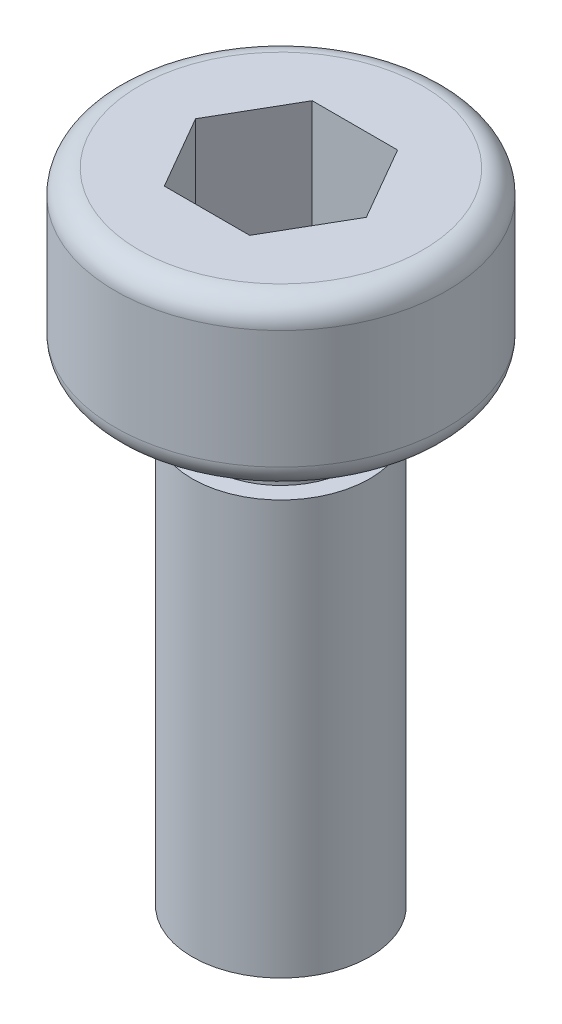
ISO-10303-21;
HEADER;
FILE_DESCRIPTION(('STEP AP214'),'2;1');
FILE_NAME('part.step','',(''),(''),'','','');
FILE_SCHEMA(('AUTOMOTIVE_DESIGN { 1 0 10303 214 1 1 1 1 }'));
ENDSEC;
DATA;
#1=APPLICATION_CONTEXT('core data for automotive mechanical design processes');
#2=APPLICATION_PROTOCOL_DEFINITION('international standard','automotive_design',2000,#1);
#3=PRODUCT_CONTEXT('',#1,'mechanical');
#4=PRODUCT('Part','Part','',(#3));
#5=PRODUCT_RELATED_PRODUCT_CATEGORY('part','',(#4));
#6=PRODUCT_DEFINITION_FORMATION('','',#4);
#7=PRODUCT_DEFINITION_CONTEXT('part definition',#1,'design');
#8=PRODUCT_DEFINITION('design','',#6,#7);
#9=PRODUCT_DEFINITION_SHAPE('','',#8);
#10=(LENGTH_UNIT() NAMED_UNIT(*) SI_UNIT(.MILLI.,.METRE.));
#11=(NAMED_UNIT(*) PLANE_ANGLE_UNIT() SI_UNIT($,.RADIAN.));
#12=(NAMED_UNIT(*) SI_UNIT($,.STERADIAN.) SOLID_ANGLE_UNIT());
#13=UNCERTAINTY_MEASURE_WITH_UNIT(LENGTH_MEASURE(1.E-05),#10,'distance_accuracy_value','');
#14=(GEOMETRIC_REPRESENTATION_CONTEXT(3) GLOBAL_UNCERTAINTY_ASSIGNED_CONTEXT((#13)) GLOBAL_UNIT_ASSIGNED_CONTEXT((#10,
#11,#12)) REPRESENTATION_CONTEXT('',''));
#15=CARTESIAN_POINT('',(0.,0.,0.));
#16=DIRECTION('',(0.,0.,1.));
#17=DIRECTION('',(1.,0.,0.));
#18=AXIS2_PLACEMENT_3D('',#15,#16,#17);
#19=CARTESIAN_POINT('',(0.,10.8,0.));
#20=DIRECTION('',(0.,-1.,0.));
#21=DIRECTION('',(0.,0.,-1.));
#22=AXIS2_PLACEMENT_3D('',#19,#20,#21);
#23=PLANE('',#22);
#24=DIRECTION('',(-0.5,0.,0.866025403784439));
#25=VECTOR('',#24,1.);
#26=CARTESIAN_POINT('',(-0.721687836487032,10.8,-1.25));
#27=LINE('',#26,#25);
#28=CARTESIAN_POINT('',(-0.721687836487032,10.8,-1.25));
#29=VERTEX_POINT('',#28);
#30=CARTESIAN_POINT('',(-1.44337567297406,10.8,0.));
#31=VERTEX_POINT('',#30);
#32=EDGE_CURVE('E124',#29,#31,#27,.T.);
#33=ORIENTED_EDGE('',*,*,#32,.F.);
#34=DIRECTION('',(-1.,0.,0.));
#35=VECTOR('',#34,1.);
#36=CARTESIAN_POINT('',(0.721687836487033,10.8,-1.25));
#37=LINE('',#36,#35);
#38=CARTESIAN_POINT('',(0.721687836487033,10.8,-1.25));
#39=VERTEX_POINT('',#38);
#40=EDGE_CURVE('E50',#39,#29,#37,.T.);
#41=ORIENTED_EDGE('',*,*,#40,.F.);
#42=DIRECTION('',(-0.5,0.,-0.866025403784439));
#43=VECTOR('',#42,1.);
#44=CARTESIAN_POINT('',(1.44337567297406,10.8,0.));
#45=LINE('',#44,#43);
#46=CARTESIAN_POINT('',(1.44337567297406,10.8,0.));
#47=VERTEX_POINT('',#46);
#48=EDGE_CURVE('E133',#47,#39,#45,.T.);
#49=ORIENTED_EDGE('',*,*,#48,.F.);
#50=DIRECTION('',(0.5,0.,-0.866025403784439));
#51=VECTOR('',#50,1.);
#52=CARTESIAN_POINT('',(0.721687836487032,10.8,1.25));
#53=LINE('',#52,#51);
#54=CARTESIAN_POINT('',(0.721687836487032,10.8,1.25));
#55=VERTEX_POINT('',#54);
#56=EDGE_CURVE('E131',#55,#47,#53,.T.);
#57=ORIENTED_EDGE('',*,*,#56,.F.);
#58=DIRECTION('',(1.,0.,0.));
#59=VECTOR('',#58,1.);
#60=CARTESIAN_POINT('',(-0.721687836487033,10.8,1.25));
#61=LINE('',#60,#59);
#62=CARTESIAN_POINT('',(-0.721687836487033,10.8,1.25));
#63=VERTEX_POINT('',#62);
#64=EDGE_CURVE('E98',#63,#55,#61,.T.);
#65=ORIENTED_EDGE('',*,*,#64,.F.);
#66=DIRECTION('',(0.5,0.,0.866025403784439));
#67=VECTOR('',#66,1.);
#68=CARTESIAN_POINT('',(-1.44337567297406,10.8,0.));
#69=LINE('',#68,#67);
#70=EDGE_CURVE('E127',#31,#63,#69,.T.);
#71=ORIENTED_EDGE('',*,*,#70,.F.);
#72=EDGE_LOOP('',(#33,#41,#49,#57,#65,#71));
#73=FACE_BOUND('',#72,.T.);
#74=CARTESIAN_POINT('',(0.,10.8,0.));
#75=DIRECTION('',(0.,-1.,0.));
#76=DIRECTION('',(0.,0.,-1.));
#77=AXIS2_PLACEMENT_3D('',#74,#75,#76);
#78=CIRCLE('',#77,2.4);
#79=CARTESIAN_POINT('',(0.,10.8,-2.4));
#80=VERTEX_POINT('',#79);
#81=EDGE_CURVE('E11',#80,#80,#78,.T.);
#82=ORIENTED_EDGE('',*,*,#81,.F.);
#83=EDGE_LOOP('',(#82));
#84=FACE_BOUND('',#83,.T.);
#85=ADVANCED_FACE('F36',(#73,#84),#23,.F.);
#86=CARTESIAN_POINT('',(0.,10.4,0.));
#87=DIRECTION('',(0.,-1.,0.));
#88=DIRECTION('',(0.,0.,-1.));
#89=AXIS2_PLACEMENT_3D('',#86,#87,#88);
#90=TOROIDAL_SURFACE('',#89,2.4,0.399999999999999);
#91=CARTESIAN_POINT('',(0.,10.4,0.));
#92=DIRECTION('',(0.,-1.,0.));
#93=DIRECTION('',(0.,0.,-1.));
#94=AXIS2_PLACEMENT_3D('',#91,#92,#93);
#95=CIRCLE('',#94,2.8);
#96=CARTESIAN_POINT('',(0.,10.4,-2.8));
#97=VERTEX_POINT('',#96);
#98=EDGE_CURVE('E43',#97,#97,#95,.T.);
#99=ORIENTED_EDGE('',*,*,#98,.F.);
#100=EDGE_LOOP('',(#99));
#101=FACE_BOUND('',#100,.T.);
#102=ORIENTED_EDGE('',*,*,#81,.T.);
#103=EDGE_LOOP('',(#102));
#104=FACE_BOUND('',#103,.T.);
#105=ADVANCED_FACE('F164',(#101,#104),#90,.T.);
#106=CARTESIAN_POINT('',(0.,0.,0.));
#107=DIRECTION('',(0.,-1.,0.));
#108=DIRECTION('',(0.,0.,-1.));
#109=AXIS2_PLACEMENT_3D('',#106,#107,#108);
#110=CYLINDRICAL_SURFACE('',#109,2.8);
#111=CARTESIAN_POINT('',(0.,8.4,0.));
#112=DIRECTION('',(0.,-1.,0.));
#113=DIRECTION('',(0.,0.,-1.));
#114=AXIS2_PLACEMENT_3D('',#111,#112,#113);
#115=CIRCLE('',#114,2.8);
#116=CARTESIAN_POINT('',(0.,8.4,-2.8));
#117=VERTEX_POINT('',#116);
#118=EDGE_CURVE('E157',#117,#117,#115,.T.);
#119=ORIENTED_EDGE('',*,*,#118,.F.);
#120=EDGE_LOOP('',(#119));
#121=FACE_BOUND('',#120,.T.);
#122=ORIENTED_EDGE('',*,*,#98,.T.);
#123=EDGE_LOOP('',(#122));
#124=FACE_BOUND('',#123,.T.);
#125=ADVANCED_FACE('F162',(#121,#124),#110,.T.);
#126=CARTESIAN_POINT('',(0.,8.4,0.));
#127=DIRECTION('',(0.,-1.,0.));
#128=DIRECTION('',(0.,0.,-1.));
#129=AXIS2_PLACEMENT_3D('',#126,#127,#128);
#130=TOROIDAL_SURFACE('',#129,2.4,0.4);
#131=CARTESIAN_POINT('',(0.,8.,0.));
#132=DIRECTION('',(0.,-1.,0.));
#133=DIRECTION('',(0.,0.,-1.));
#134=AXIS2_PLACEMENT_3D('',#131,#132,#133);
#135=CIRCLE('',#134,2.4);
#136=CARTESIAN_POINT('',(0.,8.,-2.4));
#137=VERTEX_POINT('',#136);
#138=EDGE_CURVE('E154',#137,#137,#135,.T.);
#139=ORIENTED_EDGE('',*,*,#138,.F.);
#140=EDGE_LOOP('',(#139));
#141=FACE_BOUND('',#140,.T.);
#142=ORIENTED_EDGE('',*,*,#118,.T.);
#143=EDGE_LOOP('',(#142));
#144=FACE_BOUND('',#143,.T.);
#145=ADVANCED_FACE('F209',(#141,#144),#130,.T.);
#146=CARTESIAN_POINT('',(-2.4,8.,0.));
#147=DIRECTION('',(0.,1.,0.));
#148=DIRECTION('',(0.,0.,1.));
#149=AXIS2_PLACEMENT_3D('',#146,#147,#148);
#150=PLANE('',#149);
#151=CARTESIAN_POINT('',(0.,8.,0.));
#152=DIRECTION('',(0.,-1.,0.));
#153=DIRECTION('',(0.,0.,-1.));
#154=AXIS2_PLACEMENT_3D('',#151,#152,#153);
#155=CIRCLE('',#154,1.2);
#156=CARTESIAN_POINT('',(0.,8.,-1.2));
#157=VERTEX_POINT('',#156);
#158=EDGE_CURVE('E151',#157,#157,#155,.T.);
#159=ORIENTED_EDGE('',*,*,#158,.F.);
#160=EDGE_LOOP('',(#159));
#161=FACE_BOUND('',#160,.T.);
#162=ORIENTED_EDGE('',*,*,#138,.T.);
#163=EDGE_LOOP('',(#162));
#164=FACE_BOUND('',#163,.T.);
#165=ADVANCED_FACE('F205',(#161,#164),#150,.F.);
#166=CARTESIAN_POINT('',(0.,0.,0.));
#167=DIRECTION('',(0.,-1.,0.));
#168=DIRECTION('',(0.,0.,-1.));
#169=AXIS2_PLACEMENT_3D('',#166,#167,#168);
#170=CYLINDRICAL_SURFACE('',#169,1.2);
#171=CARTESIAN_POINT('',(0.,7.,0.));
#172=DIRECTION('',(0.,-1.,0.));
#173=DIRECTION('',(0.,0.,-1.));
#174=AXIS2_PLACEMENT_3D('',#171,#172,#173);
#175=CIRCLE('',#174,1.2);
#176=CARTESIAN_POINT('',(0.,7.,-1.2));
#177=VERTEX_POINT('',#176);
#178=EDGE_CURVE('E148',#177,#177,#175,.T.);
#179=ORIENTED_EDGE('',*,*,#178,.F.);
#180=EDGE_LOOP('',(#179));
#181=FACE_BOUND('',#180,.T.);
#182=ORIENTED_EDGE('',*,*,#158,.T.);
#183=EDGE_LOOP('',(#182));
#184=FACE_BOUND('',#183,.T.);
#185=ADVANCED_FACE('F201',(#181,#184),#170,.T.);
#186=CARTESIAN_POINT('',(-1.2,7.,0.));
#187=DIRECTION('',(0.,-1.,0.));
#188=DIRECTION('',(0.,0.,-1.));
#189=AXIS2_PLACEMENT_3D('',#186,#187,#188);
#190=PLANE('',#189);
#191=CARTESIAN_POINT('',(0.,7.,0.));
#192=DIRECTION('',(0.,-1.,0.));
#193=DIRECTION('',(0.,0.,-1.));
#194=AXIS2_PLACEMENT_3D('',#191,#192,#193);
#195=CIRCLE('',#194,1.5);
#196=CARTESIAN_POINT('',(0.,7.,-1.5));
#197=VERTEX_POINT('',#196);
#198=EDGE_CURVE('E145',#197,#197,#195,.T.);
#199=ORIENTED_EDGE('',*,*,#198,.F.);
#200=EDGE_LOOP('',(#199));
#201=FACE_BOUND('',#200,.T.);
#202=ORIENTED_EDGE('',*,*,#178,.T.);
#203=EDGE_LOOP('',(#202));
#204=FACE_BOUND('',#203,.T.);
#205=ADVANCED_FACE('F197',(#201,#204),#190,.F.);
#206=CARTESIAN_POINT('',(0.,0.,0.));
#207=DIRECTION('',(0.,-1.,0.));
#208=DIRECTION('',(0.,0.,-1.));
#209=AXIS2_PLACEMENT_3D('',#206,#207,#208);
#210=CYLINDRICAL_SURFACE('',#209,1.5);
#211=CARTESIAN_POINT('',(0.,0.,0.));
#212=DIRECTION('',(0.,-1.,0.));
#213=DIRECTION('',(0.,0.,-1.));
#214=AXIS2_PLACEMENT_3D('',#211,#212,#213);
#215=CIRCLE('',#214,1.5);
#216=CARTESIAN_POINT('',(0.,0.,-1.5));
#217=VERTEX_POINT('',#216);
#218=EDGE_CURVE('E137',#217,#217,#215,.T.);
#219=ORIENTED_EDGE('',*,*,#218,.F.);
#220=EDGE_LOOP('',(#219));
#221=FACE_BOUND('',#220,.T.);
#222=ORIENTED_EDGE('',*,*,#198,.T.);
#223=EDGE_LOOP('',(#222));
#224=FACE_BOUND('',#223,.T.);
#225=ADVANCED_FACE('F189',(#221,#224),#210,.T.);
#226=CARTESIAN_POINT('',(-1.5,0.,0.));
#227=DIRECTION('',(0.,1.,0.));
#228=DIRECTION('',(0.,0.,1.));
#229=AXIS2_PLACEMENT_3D('',#226,#227,#228);
#230=PLANE('',#229);
#231=ORIENTED_EDGE('',*,*,#218,.T.);
#232=EDGE_LOOP('',(#231));
#233=FACE_BOUND('',#232,.T.);
#234=ADVANCED_FACE('F182',(#233),#230,.F.);
#235=CARTESIAN_POINT('',(0.721687836487033,8.8,-1.25));
#236=DIRECTION('',(0.,0.,-1.));
#237=DIRECTION('',(-1.,0.,0.));
#238=AXIS2_PLACEMENT_3D('',#235,#236,#237);
#239=PLANE('',#238);
#240=ORIENTED_EDGE('',*,*,#40,.T.);
#241=DIRECTION('',(0.,1.,0.));
#242=VECTOR('',#241,1.);
#243=CARTESIAN_POINT('',(-0.721687836487032,8.8,-1.25));
#244=LINE('',#243,#242);
#245=CARTESIAN_POINT('',(-0.721687836487032,8.8,-1.25));
#246=VERTEX_POINT('',#245);
#247=EDGE_CURVE('E80',#246,#29,#244,.T.);
#248=ORIENTED_EDGE('',*,*,#247,.F.);
#249=DIRECTION('',(-1.,0.,0.));
#250=VECTOR('',#249,1.);
#251=CARTESIAN_POINT('',(0.721687836487033,8.8,-1.25));
#252=LINE('',#251,#250);
#253=CARTESIAN_POINT('',(0.721687836487033,8.8,-1.25));
#254=VERTEX_POINT('',#253);
#255=EDGE_CURVE('E135',#254,#246,#252,.T.);
#256=ORIENTED_EDGE('',*,*,#255,.F.);
#257=DIRECTION('',(0.,1.,0.));
#258=VECTOR('',#257,1.);
#259=CARTESIAN_POINT('',(0.721687836487033,8.8,-1.25));
#260=LINE('',#259,#258);
#261=EDGE_CURVE('E58',#254,#39,#260,.T.);
#262=ORIENTED_EDGE('',*,*,#261,.T.);
#263=EDGE_LOOP('',(#240,#248,#256,#262));
#264=FACE_BOUND('',#263,.T.);
#265=ADVANCED_FACE('F179',(#264),#239,.F.);
#266=CARTESIAN_POINT('',(1.44337567297406,8.8,0.));
#267=DIRECTION('',(0.866025403784439,0.,-0.5));
#268=DIRECTION('',(-0.5,0.,-0.866025403784439));
#269=AXIS2_PLACEMENT_3D('',#266,#267,#268);
#270=PLANE('',#269);
#271=ORIENTED_EDGE('',*,*,#48,.T.);
#272=ORIENTED_EDGE('',*,*,#261,.F.);
#273=DIRECTION('',(-0.5,0.,-0.866025403784439));
#274=VECTOR('',#273,1.);
#275=CARTESIAN_POINT('',(1.44337567297406,8.8,0.));
#276=LINE('',#275,#274);
#277=CARTESIAN_POINT('',(1.44337567297406,8.8,0.));
#278=VERTEX_POINT('',#277);
#279=EDGE_CURVE('E110',#278,#254,#276,.T.);
#280=ORIENTED_EDGE('',*,*,#279,.F.);
#281=DIRECTION('',(0.,1.,0.));
#282=VECTOR('',#281,1.);
#283=CARTESIAN_POINT('',(1.44337567297406,8.8,0.));
#284=LINE('',#283,#282);
#285=EDGE_CURVE('E102',#278,#47,#284,.T.);
#286=ORIENTED_EDGE('',*,*,#285,.T.);
#287=EDGE_LOOP('',(#271,#272,#280,#286));
#288=FACE_BOUND('',#287,.T.);
#289=ADVANCED_FACE('F181',(#288),#270,.F.);
#290=CARTESIAN_POINT('',(0.721687836487032,8.8,1.25));
#291=DIRECTION('',(0.866025403784439,0.,0.5));
#292=DIRECTION('',(0.5,0.,-0.866025403784439));
#293=AXIS2_PLACEMENT_3D('',#290,#291,#292);
#294=PLANE('',#293);
#295=ORIENTED_EDGE('',*,*,#56,.T.);
#296=ORIENTED_EDGE('',*,*,#285,.F.);
#297=DIRECTION('',(0.5,0.,-0.866025403784439));
#298=VECTOR('',#297,1.);
#299=CARTESIAN_POINT('',(0.721687836487032,8.8,1.25));
#300=LINE('',#299,#298);
#301=CARTESIAN_POINT('',(0.721687836487032,8.8,1.25));
#302=VERTEX_POINT('',#301);
#303=EDGE_CURVE('E106',#302,#278,#300,.T.);
#304=ORIENTED_EDGE('',*,*,#303,.F.);
#305=DIRECTION('',(0.,1.,0.));
#306=VECTOR('',#305,1.);
#307=CARTESIAN_POINT('',(0.721687836487032,8.8,1.25));
#308=LINE('',#307,#306);
#309=EDGE_CURVE('E91',#302,#55,#308,.T.);
#310=ORIENTED_EDGE('',*,*,#309,.T.);
#311=EDGE_LOOP('',(#295,#296,#304,#310));
#312=FACE_BOUND('',#311,.T.);
#313=ADVANCED_FACE('F107',(#312),#294,.F.);
#314=CARTESIAN_POINT('',(-0.721687836487033,8.8,1.25));
#315=DIRECTION('',(0.,0.,1.));
#316=DIRECTION('',(1.,0.,0.));
#317=AXIS2_PLACEMENT_3D('',#314,#315,#316);
#318=PLANE('',#317);
#319=ORIENTED_EDGE('',*,*,#64,.T.);
#320=ORIENTED_EDGE('',*,*,#309,.F.);
#321=DIRECTION('',(1.,0.,0.));
#322=VECTOR('',#321,1.);
#323=CARTESIAN_POINT('',(-0.721687836487033,8.8,1.25));
#324=LINE('',#323,#322);
#325=CARTESIAN_POINT('',(-0.721687836487033,8.8,1.25));
#326=VERTEX_POINT('',#325);
#327=EDGE_CURVE('E95',#326,#302,#324,.T.);
#328=ORIENTED_EDGE('',*,*,#327,.F.);
#329=DIRECTION('',(0.,1.,0.));
#330=VECTOR('',#329,1.);
#331=CARTESIAN_POINT('',(-0.721687836487033,8.8,1.25));
#332=LINE('',#331,#330);
#333=EDGE_CURVE('E103',#326,#63,#332,.T.);
#334=ORIENTED_EDGE('',*,*,#333,.T.);
#335=EDGE_LOOP('',(#319,#320,#328,#334));
#336=FACE_BOUND('',#335,.T.);
#337=ADVANCED_FACE('F93',(#336),#318,.F.);
#338=CARTESIAN_POINT('',(-1.44337567297406,8.8,0.));
#339=DIRECTION('',(-0.866025403784439,0.,0.5));
#340=DIRECTION('',(0.5,0.,0.866025403784439));
#341=AXIS2_PLACEMENT_3D('',#338,#339,#340);
#342=PLANE('',#341);
#343=ORIENTED_EDGE('',*,*,#70,.T.);
#344=ORIENTED_EDGE('',*,*,#333,.F.);
#345=DIRECTION('',(0.5,0.,0.866025403784439));
#346=VECTOR('',#345,1.);
#347=CARTESIAN_POINT('',(-1.44337567297406,8.8,0.));
#348=LINE('',#347,#346);
#349=CARTESIAN_POINT('',(-1.44337567297406,8.8,0.));
#350=VERTEX_POINT('',#349);
#351=EDGE_CURVE('E116',#350,#326,#348,.T.);
#352=ORIENTED_EDGE('',*,*,#351,.F.);
#353=DIRECTION('',(0.,1.,0.));
#354=VECTOR('',#353,1.);
#355=CARTESIAN_POINT('',(-1.44337567297406,8.8,0.));
#356=LINE('',#355,#354);
#357=EDGE_CURVE('E140',#350,#31,#356,.T.);
#358=ORIENTED_EDGE('',*,*,#357,.T.);
#359=EDGE_LOOP('',(#343,#344,#352,#358));
#360=FACE_BOUND('',#359,.T.);
#361=ADVANCED_FACE('F280',(#360),#342,.F.);
#362=CARTESIAN_POINT('',(-0.721687836487032,8.8,-1.25));
#363=DIRECTION('',(-0.866025403784439,0.,-0.5));
#364=DIRECTION('',(-0.5,0.,0.866025403784439));
#365=AXIS2_PLACEMENT_3D('',#362,#363,#364);
#366=PLANE('',#365);
#367=ORIENTED_EDGE('',*,*,#32,.T.);
#368=ORIENTED_EDGE('',*,*,#357,.F.);
#369=DIRECTION('',(-0.5,0.,0.866025403784439));
#370=VECTOR('',#369,1.);
#371=CARTESIAN_POINT('',(-0.721687836487032,8.8,-1.25));
#372=LINE('',#371,#370);
#373=EDGE_CURVE('E118',#246,#350,#372,.T.);
#374=ORIENTED_EDGE('',*,*,#373,.F.);
#375=ORIENTED_EDGE('',*,*,#247,.T.);
#376=EDGE_LOOP('',(#367,#368,#374,#375));
#377=FACE_BOUND('',#376,.T.);
#378=ADVANCED_FACE('F177',(#377),#366,.F.);
#379=CARTESIAN_POINT('',(0.,8.8,0.));
#380=DIRECTION('',(0.,1.,0.));
#381=DIRECTION('',(0.,0.,1.));
#382=AXIS2_PLACEMENT_3D('',#379,#380,#381);
#383=PLANE('',#382);
#384=ORIENTED_EDGE('',*,*,#255,.T.);
#385=ORIENTED_EDGE('',*,*,#373,.T.);
#386=ORIENTED_EDGE('',*,*,#351,.T.);
#387=ORIENTED_EDGE('',*,*,#327,.T.);
#388=ORIENTED_EDGE('',*,*,#303,.T.);
#389=ORIENTED_EDGE('',*,*,#279,.T.);
#390=EDGE_LOOP('',(#384,#385,#386,#387,#388,#389));
#391=FACE_BOUND('',#390,.T.);
#392=ADVANCED_FACE('F113',(#391),#383,.T.);
#393=CLOSED_SHELL('',(#85,#105,#125,#145,#165,#185,#205,#225,#234,#265,#289,#313,#337,#361,#378,#392));
#394=MANIFOLD_SOLID_BREP('B2',#393);
#395=ADVANCED_BREP_SHAPE_REPRESENTATION('',(#18,#394),#14);
#396=SHAPE_DEFINITION_REPRESENTATION(#9,#395);
ENDSEC;
END-ISO-10303-21;
